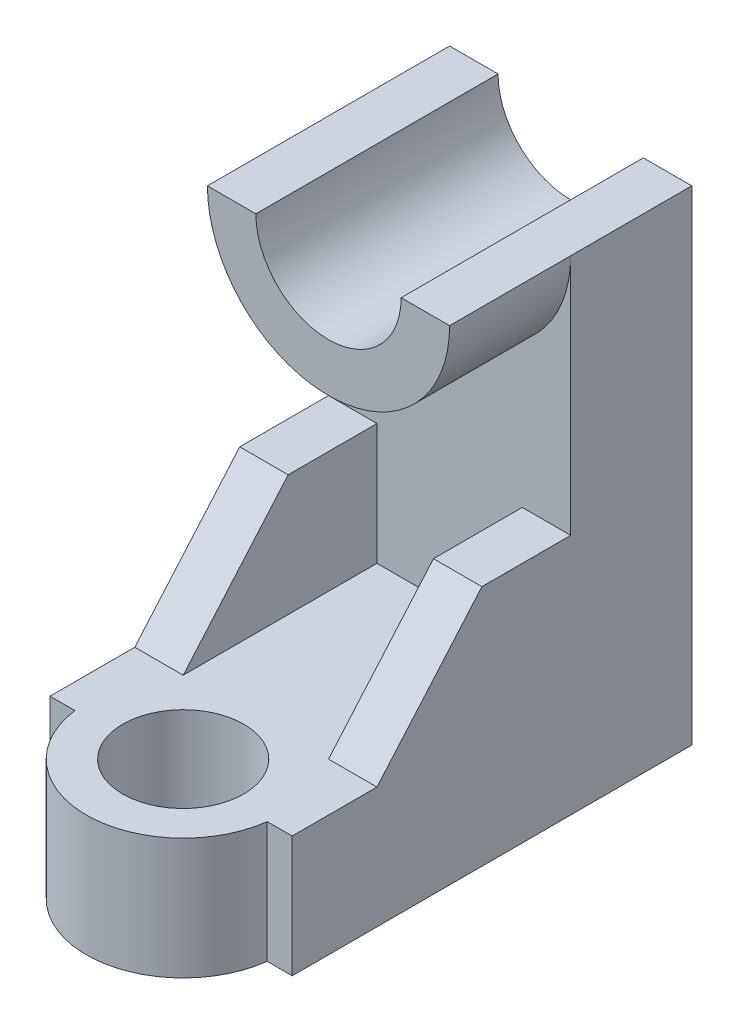
ISO-10303-21;
HEADER;
FILE_DESCRIPTION(('STEP AP214'),'2;1');
FILE_NAME('part.step','',(''),(''),'','','');
FILE_SCHEMA(('AUTOMOTIVE_DESIGN { 1 0 10303 214 1 1 1 1 }'));
ENDSEC;
DATA;
#1=APPLICATION_CONTEXT('core data for automotive mechanical design processes');
#2=APPLICATION_PROTOCOL_DEFINITION('international standard','automotive_design',2000,#1);
#3=PRODUCT_CONTEXT('',#1,'mechanical');
#4=PRODUCT('Part','Part','',(#3));
#5=PRODUCT_RELATED_PRODUCT_CATEGORY('part','',(#4));
#6=PRODUCT_DEFINITION_FORMATION('','',#4);
#7=PRODUCT_DEFINITION_CONTEXT('part definition',#1,'design');
#8=PRODUCT_DEFINITION('design','',#6,#7);
#9=PRODUCT_DEFINITION_SHAPE('','',#8);
#10=(LENGTH_UNIT() NAMED_UNIT(*) SI_UNIT(.MILLI.,.METRE.));
#11=(NAMED_UNIT(*) PLANE_ANGLE_UNIT() SI_UNIT($,.RADIAN.));
#12=(NAMED_UNIT(*) SI_UNIT($,.STERADIAN.) SOLID_ANGLE_UNIT());
#13=UNCERTAINTY_MEASURE_WITH_UNIT(LENGTH_MEASURE(1.E-05),#10,'distance_accuracy_value','');
#14=(GEOMETRIC_REPRESENTATION_CONTEXT(3) GLOBAL_UNCERTAINTY_ASSIGNED_CONTEXT((#13)) GLOBAL_UNIT_ASSIGNED_CONTEXT((#10,
#11,#12)) REPRESENTATION_CONTEXT('',''));
#15=CARTESIAN_POINT('',(0.,0.,0.));
#16=DIRECTION('',(0.,0.,1.));
#17=DIRECTION('',(1.,0.,0.));
#18=AXIS2_PLACEMENT_3D('',#15,#16,#17);
#19=CARTESIAN_POINT('',(0.,-40.8235887096774,100.));
#20=DIRECTION('',(0.,-1.,0.));
#21=DIRECTION('',(0.,0.,-1.));
#22=AXIS2_PLACEMENT_3D('',#19,#20,#21);
#23=PLANE('',#22);
#24=DIRECTION('',(0.,0.,-1.));
#25=VECTOR('',#24,1.);
#26=CARTESIAN_POINT('',(-75.1370967741936,-40.8235887096774,65.));
#27=LINE('',#26,#25);
#28=CARTESIAN_POINT('',(-75.1370967741936,-40.8235887096774,65.));
#29=VERTEX_POINT('',#28);
#30=CARTESIAN_POINT('',(-75.1370967741936,-40.8235887096774,25.));
#31=VERTEX_POINT('',#30);
#32=EDGE_CURVE('E298',#29,#31,#27,.T.);
#33=ORIENTED_EDGE('',*,*,#32,.F.);
#34=DIRECTION('',(-1.,0.,0.));
#35=VECTOR('',#34,1.);
#36=CARTESIAN_POINT('',(0.,-40.8235887096774,65.));
#37=LINE('',#36,#35);
#38=CARTESIAN_POINT('',(-85.1370967741936,-40.8235887096774,65.));
#39=VERTEX_POINT('',#38);
#40=EDGE_CURVE('E295',#29,#39,#37,.T.);
#41=ORIENTED_EDGE('',*,*,#40,.T.);
#42=DIRECTION('',(0.,0.,-1.));
#43=VECTOR('',#42,1.);
#44=CARTESIAN_POINT('',(-85.1370967741936,-40.8235887096774,100.));
#45=LINE('',#44,#43);
#46=CARTESIAN_POINT('',(-85.1370967741936,-40.8235887096774,82.5));
#47=VERTEX_POINT('',#46);
#48=EDGE_CURVE('E70',#47,#39,#45,.T.);
#49=ORIENTED_EDGE('',*,*,#48,.F.);
#50=DIRECTION('',(-1.,0.,0.));
#51=VECTOR('',#50,1.);
#52=CARTESIAN_POINT('',(0.,-40.8235887096774,82.5));
#53=LINE('',#52,#51);
#54=CARTESIAN_POINT('',(-79.980231607178,-40.8235887096774,82.5));
#55=VERTEX_POINT('',#54);
#56=EDGE_CURVE('E340',#55,#47,#53,.T.);
#57=ORIENTED_EDGE('',*,*,#56,.F.);
#58=CARTESIAN_POINT('',(-60.1370967741936,-40.8235887096774,80.));
#59=DIRECTION('',(0.,1.,0.));
#60=DIRECTION('',(0.,0.,1.));
#61=AXIS2_PLACEMENT_3D('',#58,#59,#60);
#62=CIRCLE('',#61,20.);
#63=CARTESIAN_POINT('',(-40.2939619412091,-40.8235887096774,82.5));
#64=VERTEX_POINT('',#63);
#65=EDGE_CURVE('E360',#55,#64,#62,.T.);
#66=ORIENTED_EDGE('',*,*,#65,.T.);
#67=DIRECTION('',(-1.,0.,0.));
#68=VECTOR('',#67,1.);
#69=CARTESIAN_POINT('',(0.,-40.8235887096774,82.5));
#70=LINE('',#69,#68);
#71=CARTESIAN_POINT('',(-35.1370967741936,-40.8235887096774,82.5));
#72=VERTEX_POINT('',#71);
#73=EDGE_CURVE('E209',#72,#64,#70,.T.);
#74=ORIENTED_EDGE('',*,*,#73,.F.);
#75=DIRECTION('',(0.,0.,-1.));
#76=VECTOR('',#75,1.);
#77=CARTESIAN_POINT('',(-35.1370967741936,-40.8235887096774,100.));
#78=LINE('',#77,#76);
#79=CARTESIAN_POINT('',(-35.1370967741936,-40.8235887096774,65.));
#80=VERTEX_POINT('',#79);
#81=EDGE_CURVE('E201',#72,#80,#78,.T.);
#82=ORIENTED_EDGE('',*,*,#81,.T.);
#83=DIRECTION('',(-1.,0.,0.));
#84=VECTOR('',#83,1.);
#85=CARTESIAN_POINT('',(0.,-40.8235887096774,65.));
#86=LINE('',#85,#84);
#87=CARTESIAN_POINT('',(-45.1370967741936,-40.8235887096774,65.));
#88=VERTEX_POINT('',#87);
#89=EDGE_CURVE('E184',#80,#88,#86,.T.);
#90=ORIENTED_EDGE('',*,*,#89,.T.);
#91=DIRECTION('',(0.,0.,-1.));
#92=VECTOR('',#91,1.);
#93=CARTESIAN_POINT('',(-45.1370967741936,-40.8235887096774,65.));
#94=LINE('',#93,#92);
#95=CARTESIAN_POINT('',(-45.1370967741936,-40.8235887096774,25.));
#96=VERTEX_POINT('',#95);
#97=EDGE_CURVE('E291',#88,#96,#94,.T.);
#98=ORIENTED_EDGE('',*,*,#97,.T.);
#99=DIRECTION('',(-1.,0.,0.));
#100=VECTOR('',#99,1.);
#101=CARTESIAN_POINT('',(0.,-40.8235887096774,25.));
#102=LINE('',#101,#100);
#103=EDGE_CURVE('E77',#96,#31,#102,.T.);
#104=ORIENTED_EDGE('',*,*,#103,.T.);
#105=EDGE_LOOP('',(#33,#41,#49,#57,#66,#74,#82,#90,#98,#104));
#106=FACE_BOUND('',#105,.T.);
#107=CARTESIAN_POINT('',(-60.1370967741936,-40.8235887096774,80.));
#108=DIRECTION('',(0.,1.,0.));
#109=DIRECTION('',(0.,0.,1.));
#110=AXIS2_PLACEMENT_3D('',#107,#108,#109);
#111=CIRCLE('',#110,12.5);
#112=CARTESIAN_POINT('',(-60.1370967741936,-40.8235887096774,92.5));
#113=VERTEX_POINT('',#112);
#114=EDGE_CURVE('E235',#113,#113,#111,.T.);
#115=ORIENTED_EDGE('',*,*,#114,.F.);
#116=EDGE_LOOP('',(#115));
#117=FACE_BOUND('',#116,.T.);
#118=ADVANCED_FACE('F63',(#106,#117),#23,.F.);
#119=CARTESIAN_POINT('',(0.,-65.8235887096774,100.));
#120=DIRECTION('',(0.,1.,0.));
#121=DIRECTION('',(0.,0.,1.));
#122=AXIS2_PLACEMENT_3D('',#119,#120,#121);
#123=PLANE('',#122);
#124=CARTESIAN_POINT('',(-60.1370967741936,-65.8235887096774,80.));
#125=DIRECTION('',(0.,1.,0.));
#126=DIRECTION('',(0.,0.,1.));
#127=AXIS2_PLACEMENT_3D('',#124,#125,#126);
#128=CIRCLE('',#127,12.5);
#129=CARTESIAN_POINT('',(-60.1370967741936,-65.8235887096774,92.5));
#130=VERTEX_POINT('',#129);
#131=EDGE_CURVE('E221',#130,#130,#128,.T.);
#132=ORIENTED_EDGE('',*,*,#131,.T.);
#133=EDGE_LOOP('',(#132));
#134=FACE_BOUND('',#133,.T.);
#135=CARTESIAN_POINT('',(-60.1370967741936,-65.8235887096774,80.));
#136=DIRECTION('',(0.,1.,0.));
#137=DIRECTION('',(0.,0.,1.));
#138=AXIS2_PLACEMENT_3D('',#135,#136,#137);
#139=CIRCLE('',#138,20.);
#140=CARTESIAN_POINT('',(-79.980231607178,-65.8235887096774,82.5));
#141=VERTEX_POINT('',#140);
#142=CARTESIAN_POINT('',(-40.2939619412091,-65.8235887096774,82.5));
#143=VERTEX_POINT('',#142);
#144=EDGE_CURVE('E231',#141,#143,#139,.T.);
#145=ORIENTED_EDGE('',*,*,#144,.F.);
#146=DIRECTION('',(-1.,0.,0.));
#147=VECTOR('',#146,1.);
#148=CARTESIAN_POINT('',(0.,-65.8235887096774,82.5));
#149=LINE('',#148,#147);
#150=CARTESIAN_POINT('',(-85.1370967741936,-65.8235887096774,82.5));
#151=VERTEX_POINT('',#150);
#152=EDGE_CURVE('E358',#141,#151,#149,.T.);
#153=ORIENTED_EDGE('',*,*,#152,.T.);
#154=DIRECTION('',(0.,0.,-1.));
#155=VECTOR('',#154,1.);
#156=CARTESIAN_POINT('',(-85.1370967741936,-65.8235887096774,100.));
#157=LINE('',#156,#155);
#158=CARTESIAN_POINT('',(-85.1370967741936,-65.8235887096774,0.));
#159=VERTEX_POINT('',#158);
#160=EDGE_CURVE('E213',#151,#159,#157,.T.);
#161=ORIENTED_EDGE('',*,*,#160,.T.);
#162=DIRECTION('',(1.,0.,0.));
#163=VECTOR('',#162,1.);
#164=CARTESIAN_POINT('',(0.,-65.8235887096774,0.));
#165=LINE('',#164,#163);
#166=CARTESIAN_POINT('',(-35.1370967741936,-65.8235887096774,0.));
#167=VERTEX_POINT('',#166);
#168=EDGE_CURVE('E215',#159,#167,#165,.T.);
#169=ORIENTED_EDGE('',*,*,#168,.T.);
#170=DIRECTION('',(0.,0.,-1.));
#171=VECTOR('',#170,1.);
#172=CARTESIAN_POINT('',(-35.1370967741936,-65.8235887096774,100.));
#173=LINE('',#172,#171);
#174=CARTESIAN_POINT('',(-35.1370967741936,-65.8235887096774,82.5));
#175=VERTEX_POINT('',#174);
#176=EDGE_CURVE('E210',#175,#167,#173,.T.);
#177=ORIENTED_EDGE('',*,*,#176,.F.);
#178=DIRECTION('',(-1.,0.,0.));
#179=VECTOR('',#178,1.);
#180=CARTESIAN_POINT('',(0.,-65.8235887096774,82.5));
#181=LINE('',#180,#179);
#182=EDGE_CURVE('E224',#175,#143,#181,.T.);
#183=ORIENTED_EDGE('',*,*,#182,.T.);
#184=EDGE_LOOP('',(#145,#153,#161,#169,#177,#183));
#185=FACE_BOUND('',#184,.T.);
#186=ADVANCED_FACE('F308',(#134,#185),#123,.F.);
#187=CARTESIAN_POINT('',(-85.1370967741936,0.,100.));
#188=DIRECTION('',(1.,0.,0.));
#189=DIRECTION('',(0.,0.,-1.));
#190=AXIS2_PLACEMENT_3D('',#187,#188,#189);
#191=PLANE('',#190);
#192=ORIENTED_EDGE('',*,*,#48,.T.);
#193=DIRECTION('',(0.,0.755689082789818,-0.654930538417842));
#194=VECTOR('',#193,1.);
#195=CARTESIAN_POINT('',(-85.1370967741936,-34.8329606394302,59.808122339119));
#196=LINE('',#195,#194);
#197=CARTESIAN_POINT('',(-85.1370967741936,-15.8235887096774,43.3333333333333));
#198=VERTEX_POINT('',#197);
#199=EDGE_CURVE('E345',#39,#198,#196,.T.);
#200=ORIENTED_EDGE('',*,*,#199,.T.);
#201=DIRECTION('',(0.,0.,-1.));
#202=VECTOR('',#201,1.);
#203=CARTESIAN_POINT('',(-85.1370967741936,-15.8235887096774,65.));
#204=LINE('',#203,#202);
#205=CARTESIAN_POINT('',(-85.1370967741936,-15.8235887096774,25.));
#206=VERTEX_POINT('',#205);
#207=EDGE_CURVE('E300',#198,#206,#204,.T.);
#208=ORIENTED_EDGE('',*,*,#207,.T.);
#209=DIRECTION('',(0.,1.,0.));
#210=VECTOR('',#209,1.);
#211=CARTESIAN_POINT('',(-85.1370967741936,0.,25.));
#212=LINE('',#211,#210);
#213=CARTESIAN_POINT('',(-85.1370967741936,34.1764112903226,25.));
#214=VERTEX_POINT('',#213);
#215=EDGE_CURVE('E268',#206,#214,#212,.T.);
#216=ORIENTED_EDGE('',*,*,#215,.T.);
#217=DIRECTION('',(0.,0.,-1.));
#218=VECTOR('',#217,1.);
#219=CARTESIAN_POINT('',(-85.1370967741936,34.1764112903226,25.));
#220=LINE('',#219,#218);
#221=CARTESIAN_POINT('',(-85.1370967741936,34.1764112903226,0.));
#222=VERTEX_POINT('',#221);
#223=EDGE_CURVE('E194',#214,#222,#220,.T.);
#224=ORIENTED_EDGE('',*,*,#223,.T.);
#225=DIRECTION('',(0.,-1.,0.));
#226=VECTOR('',#225,1.);
#227=CARTESIAN_POINT('',(-85.1370967741936,0.,0.));
#228=LINE('',#227,#226);
#229=EDGE_CURVE('E303',#222,#159,#228,.T.);
#230=ORIENTED_EDGE('',*,*,#229,.T.);
#231=ORIENTED_EDGE('',*,*,#160,.F.);
#232=DIRECTION('',(0.,1.,0.));
#233=VECTOR('',#232,1.);
#234=CARTESIAN_POINT('',(-85.1370967741936,0.,82.5));
#235=LINE('',#234,#233);
#236=EDGE_CURVE('E12',#151,#47,#235,.T.);
#237=ORIENTED_EDGE('',*,*,#236,.T.);
#238=EDGE_LOOP('',(#192,#200,#208,#216,#224,#230,#231,#237));
#239=FACE_BOUND('',#238,.T.);
#240=ADVANCED_FACE('F329',(#239),#191,.F.);
#241=CARTESIAN_POINT('',(-35.1370967741936,0.,100.));
#242=DIRECTION('',(-1.,0.,0.));
#243=DIRECTION('',(0.,0.,1.));
#244=AXIS2_PLACEMENT_3D('',#241,#242,#243);
#245=PLANE('',#244);
#246=DIRECTION('',(0.,0.,-1.));
#247=VECTOR('',#246,1.);
#248=CARTESIAN_POINT('',(-35.1370967741936,-15.8235887096774,65.));
#249=LINE('',#248,#247);
#250=CARTESIAN_POINT('',(-35.1370967741936,-15.8235887096774,43.3333333333333));
#251=VERTEX_POINT('',#250);
#252=CARTESIAN_POINT('',(-35.1370967741936,-15.8235887096774,25.));
#253=VERTEX_POINT('',#252);
#254=EDGE_CURVE('E193',#251,#253,#249,.T.);
#255=ORIENTED_EDGE('',*,*,#254,.F.);
#256=DIRECTION('',(0.,0.755689082789818,-0.654930538417842));
#257=VECTOR('',#256,1.);
#258=CARTESIAN_POINT('',(-35.1370967741936,14.6594251473719,16.9147213238906));
#259=LINE('',#258,#257);
#260=EDGE_CURVE('E187',#80,#251,#259,.T.);
#261=ORIENTED_EDGE('',*,*,#260,.F.);
#262=ORIENTED_EDGE('',*,*,#81,.F.);
#263=DIRECTION('',(0.,1.,0.));
#264=VECTOR('',#263,1.);
#265=CARTESIAN_POINT('',(-35.1370967741936,-96.8235887096774,82.5));
#266=LINE('',#265,#264);
#267=EDGE_CURVE('E363',#175,#72,#266,.T.);
#268=ORIENTED_EDGE('',*,*,#267,.F.);
#269=ORIENTED_EDGE('',*,*,#176,.T.);
#270=DIRECTION('',(0.,1.,0.));
#271=VECTOR('',#270,1.);
#272=CARTESIAN_POINT('',(-35.1370967741936,0.,0.));
#273=LINE('',#272,#271);
#274=CARTESIAN_POINT('',(-35.1370967741936,34.1764112903226,0.));
#275=VERTEX_POINT('',#274);
#276=EDGE_CURVE('E211',#167,#275,#273,.T.);
#277=ORIENTED_EDGE('',*,*,#276,.T.);
#278=DIRECTION('',(0.,0.,-1.));
#279=VECTOR('',#278,1.);
#280=CARTESIAN_POINT('',(-35.1370967741936,34.1764112903226,25.));
#281=LINE('',#280,#279);
#282=CARTESIAN_POINT('',(-35.1370967741936,34.1764112903226,25.));
#283=VERTEX_POINT('',#282);
#284=EDGE_CURVE('E285',#283,#275,#281,.T.);
#285=ORIENTED_EDGE('',*,*,#284,.F.);
#286=DIRECTION('',(0.,-1.,0.));
#287=VECTOR('',#286,1.);
#288=CARTESIAN_POINT('',(-35.1370967741936,0.,25.));
#289=LINE('',#288,#287);
#290=EDGE_CURVE('E283',#283,#253,#289,.T.);
#291=ORIENTED_EDGE('',*,*,#290,.T.);
#292=EDGE_LOOP('',(#255,#261,#262,#268,#269,#277,#285,#291));
#293=FACE_BOUND('',#292,.T.);
#294=ADVANCED_FACE('F199',(#293),#245,.F.);
#295=CARTESIAN_POINT('',(0.,0.,0.));
#296=DIRECTION('',(0.,0.,1.));
#297=DIRECTION('',(1.,0.,0.));
#298=AXIS2_PLACEMENT_3D('',#295,#296,#297);
#299=PLANE('',#298);
#300=ORIENTED_EDGE('',*,*,#229,.F.);
#301=DIRECTION('',(1.,0.,0.));
#302=VECTOR('',#301,1.);
#303=CARTESIAN_POINT('',(0.,34.1764112903226,0.));
#304=LINE('',#303,#302);
#305=CARTESIAN_POINT('',(-75.1370967741936,34.1764112903226,0.));
#306=VERTEX_POINT('',#305);
#307=EDGE_CURVE('E228',#222,#306,#304,.T.);
#308=ORIENTED_EDGE('',*,*,#307,.T.);
#309=CARTESIAN_POINT('',(-60.1370967741936,34.1764112903226,0.));
#310=DIRECTION('',(0.,0.,1.));
#311=DIRECTION('',(1.,0.,0.));
#312=AXIS2_PLACEMENT_3D('',#309,#310,#311);
#313=CIRCLE('',#312,15.);
#314=CARTESIAN_POINT('',(-45.1370967741936,34.1764112903226,0.));
#315=VERTEX_POINT('',#314);
#316=EDGE_CURVE('E223',#306,#315,#313,.T.);
#317=ORIENTED_EDGE('',*,*,#316,.T.);
#318=DIRECTION('',(1.,0.,0.));
#319=VECTOR('',#318,1.);
#320=CARTESIAN_POINT('',(0.,34.1764112903226,0.));
#321=LINE('',#320,#319);
#322=EDGE_CURVE('E243',#315,#275,#321,.T.);
#323=ORIENTED_EDGE('',*,*,#322,.T.);
#324=ORIENTED_EDGE('',*,*,#276,.F.);
#325=ORIENTED_EDGE('',*,*,#168,.F.);
#326=EDGE_LOOP('',(#300,#308,#317,#323,#324,#325));
#327=FACE_BOUND('',#326,.T.);
#328=ADVANCED_FACE('F312',(#327),#299,.F.);
#329=CARTESIAN_POINT('',(-75.1370967741936,0.,65.));
#330=DIRECTION('',(1.,0.,0.));
#331=DIRECTION('',(0.,0.,-1.));
#332=AXIS2_PLACEMENT_3D('',#329,#330,#331);
#333=PLANE('',#332);
#334=DIRECTION('',(0.,0.755689082789818,-0.654930538417842));
#335=VECTOR('',#334,1.);
#336=CARTESIAN_POINT('',(-75.1370967741936,-17.5106256140495,44.7954319837891));
#337=LINE('',#336,#335);
#338=CARTESIAN_POINT('',(-75.1370967741936,-15.8235887096774,43.3333333333333));
#339=VERTEX_POINT('',#338);
#340=EDGE_CURVE('E344',#29,#339,#337,.T.);
#341=ORIENTED_EDGE('',*,*,#340,.F.);
#342=ORIENTED_EDGE('',*,*,#32,.T.);
#343=DIRECTION('',(0.,-1.,0.));
#344=VECTOR('',#343,1.);
#345=CARTESIAN_POINT('',(-75.1370967741936,0.,25.));
#346=LINE('',#345,#344);
#347=CARTESIAN_POINT('',(-75.1370967741936,-15.8235887096774,25.));
#348=VERTEX_POINT('',#347);
#349=EDGE_CURVE('E274',#348,#31,#346,.T.);
#350=ORIENTED_EDGE('',*,*,#349,.F.);
#351=DIRECTION('',(0.,0.,-1.));
#352=VECTOR('',#351,1.);
#353=CARTESIAN_POINT('',(-75.1370967741936,-15.8235887096774,65.));
#354=LINE('',#353,#352);
#355=EDGE_CURVE('E85',#339,#348,#354,.T.);
#356=ORIENTED_EDGE('',*,*,#355,.F.);
#357=EDGE_LOOP('',(#341,#342,#350,#356));
#358=FACE_BOUND('',#357,.T.);
#359=ADVANCED_FACE('F347',(#358),#333,.T.);
#360=CARTESIAN_POINT('',(0.,-15.8235887096774,65.));
#361=DIRECTION('',(0.,1.,0.));
#362=DIRECTION('',(0.,0.,1.));
#363=AXIS2_PLACEMENT_3D('',#360,#361,#362);
#364=PLANE('',#363);
#365=DIRECTION('',(1.,0.,0.));
#366=VECTOR('',#365,1.);
#367=CARTESIAN_POINT('',(-91.1370967741936,-15.8235887096774,43.3333333333333));
#368=LINE('',#367,#366);
#369=EDGE_CURVE('E350',#198,#339,#368,.T.);
#370=ORIENTED_EDGE('',*,*,#369,.T.);
#371=ORIENTED_EDGE('',*,*,#355,.T.);
#372=DIRECTION('',(1.,0.,0.));
#373=VECTOR('',#372,1.);
#374=CARTESIAN_POINT('',(0.,-15.8235887096774,25.));
#375=LINE('',#374,#373);
#376=EDGE_CURVE('E271',#206,#348,#375,.T.);
#377=ORIENTED_EDGE('',*,*,#376,.F.);
#378=ORIENTED_EDGE('',*,*,#207,.F.);
#379=EDGE_LOOP('',(#370,#371,#377,#378));
#380=FACE_BOUND('',#379,.T.);
#381=ADVANCED_FACE('F386',(#380),#364,.T.);
#382=CARTESIAN_POINT('',(0.,-15.8235887096774,65.));
#383=DIRECTION('',(0.,-1.,0.));
#384=DIRECTION('',(0.,0.,-1.));
#385=AXIS2_PLACEMENT_3D('',#382,#383,#384);
#386=PLANE('',#385);
#387=DIRECTION('',(0.,0.,-1.));
#388=VECTOR('',#387,1.);
#389=CARTESIAN_POINT('',(-45.1370967741936,-15.8235887096774,65.));
#390=LINE('',#389,#388);
#391=CARTESIAN_POINT('',(-45.1370967741936,-15.8235887096774,43.3333333333333));
#392=VERTEX_POINT('',#391);
#393=CARTESIAN_POINT('',(-45.1370967741936,-15.8235887096774,25.));
#394=VERTEX_POINT('',#393);
#395=EDGE_CURVE('E293',#392,#394,#390,.T.);
#396=ORIENTED_EDGE('',*,*,#395,.F.);
#397=EDGE_CURVE('E203',#392,#251,#368,.T.);
#398=ORIENTED_EDGE('',*,*,#397,.T.);
#399=ORIENTED_EDGE('',*,*,#254,.T.);
#400=DIRECTION('',(-1.,0.,0.));
#401=VECTOR('',#400,1.);
#402=CARTESIAN_POINT('',(0.,-15.8235887096774,25.));
#403=LINE('',#402,#401);
#404=EDGE_CURVE('E280',#253,#394,#403,.T.);
#405=ORIENTED_EDGE('',*,*,#404,.T.);
#406=EDGE_LOOP('',(#396,#398,#399,#405));
#407=FACE_BOUND('',#406,.T.);
#408=ADVANCED_FACE('F389',(#407),#386,.F.);
#409=CARTESIAN_POINT('',(-45.1370967741936,0.,65.));
#410=DIRECTION('',(1.,0.,0.));
#411=DIRECTION('',(0.,0.,-1.));
#412=AXIS2_PLACEMENT_3D('',#409,#410,#411);
#413=PLANE('',#412);
#414=ORIENTED_EDGE('',*,*,#97,.F.);
#415=DIRECTION('',(0.,0.755689082789818,-0.654930538417842));
#416=VECTOR('',#415,1.);
#417=CARTESIAN_POINT('',(-45.1370967741936,-17.5106256140495,44.7954319837891));
#418=LINE('',#417,#416);
#419=EDGE_CURVE('E190',#88,#392,#418,.T.);
#420=ORIENTED_EDGE('',*,*,#419,.T.);
#421=ORIENTED_EDGE('',*,*,#395,.T.);
#422=DIRECTION('',(0.,-1.,0.));
#423=VECTOR('',#422,1.);
#424=CARTESIAN_POINT('',(-45.1370967741936,0.,25.));
#425=LINE('',#424,#423);
#426=EDGE_CURVE('E278',#394,#96,#425,.T.);
#427=ORIENTED_EDGE('',*,*,#426,.T.);
#428=EDGE_LOOP('',(#414,#420,#421,#427));
#429=FACE_BOUND('',#428,.T.);
#430=ADVANCED_FACE('F392',(#429),#413,.F.);
#431=CARTESIAN_POINT('',(0.,0.,25.));
#432=DIRECTION('',(0.,0.,1.));
#433=DIRECTION('',(1.,0.,0.));
#434=AXIS2_PLACEMENT_3D('',#431,#432,#433);
#435=PLANE('',#434);
#436=CARTESIAN_POINT('',(-60.1370967741936,34.1764112903226,25.));
#437=DIRECTION('',(0.,0.,1.));
#438=DIRECTION('',(1.,0.,0.));
#439=AXIS2_PLACEMENT_3D('',#436,#437,#438);
#440=CIRCLE('',#439,25.);
#441=EDGE_CURVE('E265',#214,#283,#440,.T.);
#442=ORIENTED_EDGE('',*,*,#441,.F.);
#443=ORIENTED_EDGE('',*,*,#215,.F.);
#444=ORIENTED_EDGE('',*,*,#376,.T.);
#445=ORIENTED_EDGE('',*,*,#349,.T.);
#446=ORIENTED_EDGE('',*,*,#103,.F.);
#447=ORIENTED_EDGE('',*,*,#426,.F.);
#448=ORIENTED_EDGE('',*,*,#404,.F.);
#449=ORIENTED_EDGE('',*,*,#290,.F.);
#450=EDGE_LOOP('',(#442,#443,#444,#445,#446,#447,#448,#449));
#451=FACE_BOUND('',#450,.T.);
#452=ADVANCED_FACE('F325',(#451),#435,.T.);
#453=CARTESIAN_POINT('',(-60.1370967741936,34.1764112903226,50.));
#454=DIRECTION('',(0.,0.,-1.));
#455=DIRECTION('',(-1.,0.,0.));
#456=AXIS2_PLACEMENT_3D('',#453,#454,#455);
#457=CYLINDRICAL_SURFACE('',#456,15.);
#458=ORIENTED_EDGE('',*,*,#316,.F.);
#459=DIRECTION('',(0.,0.,-1.));
#460=VECTOR('',#459,1.);
#461=CARTESIAN_POINT('',(-75.1370967741936,34.1764112903226,50.));
#462=LINE('',#461,#460);
#463=CARTESIAN_POINT('',(-75.1370967741936,34.1764112903226,50.));
#464=VERTEX_POINT('',#463);
#465=EDGE_CURVE('E263',#464,#306,#462,.T.);
#466=ORIENTED_EDGE('',*,*,#465,.F.);
#467=CARTESIAN_POINT('',(-60.1370967741936,34.1764112903226,50.));
#468=DIRECTION('',(0.,0.,1.));
#469=DIRECTION('',(1.,0.,0.));
#470=AXIS2_PLACEMENT_3D('',#467,#468,#469);
#471=CIRCLE('',#470,15.);
#472=CARTESIAN_POINT('',(-45.1370967741936,34.1764112903226,50.));
#473=VERTEX_POINT('',#472);
#474=EDGE_CURVE('E239',#464,#473,#471,.T.);
#475=ORIENTED_EDGE('',*,*,#474,.T.);
#476=DIRECTION('',(0.,0.,-1.));
#477=VECTOR('',#476,1.);
#478=CARTESIAN_POINT('',(-45.1370967741936,34.1764112903226,50.));
#479=LINE('',#478,#477);
#480=EDGE_CURVE('E250',#473,#315,#479,.T.);
#481=ORIENTED_EDGE('',*,*,#480,.T.);
#482=EDGE_LOOP('',(#458,#466,#475,#481));
#483=FACE_BOUND('',#482,.T.);
#484=ADVANCED_FACE('F399',(#483),#457,.F.);
#485=CARTESIAN_POINT('',(0.,34.1764112903226,50.));
#486=DIRECTION('',(0.,1.,0.));
#487=DIRECTION('',(0.,0.,1.));
#488=AXIS2_PLACEMENT_3D('',#485,#486,#487);
#489=PLANE('',#488);
#490=ORIENTED_EDGE('',*,*,#307,.F.);
#491=ORIENTED_EDGE('',*,*,#223,.F.);
#492=DIRECTION('',(0.,0.,-1.));
#493=VECTOR('',#492,1.);
#494=CARTESIAN_POINT('',(-85.1370967741936,34.1764112903226,50.));
#495=LINE('',#494,#493);
#496=CARTESIAN_POINT('',(-85.1370967741936,34.1764112903226,50.));
#497=VERTEX_POINT('',#496);
#498=EDGE_CURVE('E260',#497,#214,#495,.T.);
#499=ORIENTED_EDGE('',*,*,#498,.F.);
#500=DIRECTION('',(1.,0.,0.));
#501=VECTOR('',#500,1.);
#502=CARTESIAN_POINT('',(0.,34.1764112903226,50.));
#503=LINE('',#502,#501);
#504=EDGE_CURVE('E242',#497,#464,#503,.T.);
#505=ORIENTED_EDGE('',*,*,#504,.T.);
#506=ORIENTED_EDGE('',*,*,#465,.T.);
#507=EDGE_LOOP('',(#490,#491,#499,#505,#506));
#508=FACE_BOUND('',#507,.T.);
#509=ADVANCED_FACE('F334',(#508),#489,.T.);
#510=CARTESIAN_POINT('',(-60.1370967741936,34.1764112903226,50.));
#511=DIRECTION('',(0.,0.,-1.));
#512=DIRECTION('',(-1.,0.,0.));
#513=AXIS2_PLACEMENT_3D('',#510,#511,#512);
#514=CYLINDRICAL_SURFACE('',#513,25.);
#515=ORIENTED_EDGE('',*,*,#441,.T.);
#516=DIRECTION('',(0.,0.,-1.));
#517=VECTOR('',#516,1.);
#518=CARTESIAN_POINT('',(-35.1370967741936,34.1764112903226,50.));
#519=LINE('',#518,#517);
#520=CARTESIAN_POINT('',(-35.1370967741936,34.1764112903226,50.));
#521=VERTEX_POINT('',#520);
#522=EDGE_CURVE('E257',#521,#283,#519,.T.);
#523=ORIENTED_EDGE('',*,*,#522,.F.);
#524=CARTESIAN_POINT('',(-60.1370967741936,34.1764112903226,50.));
#525=DIRECTION('',(0.,0.,1.));
#526=DIRECTION('',(1.,0.,0.));
#527=AXIS2_PLACEMENT_3D('',#524,#525,#526);
#528=CIRCLE('',#527,25.);
#529=EDGE_CURVE('E246',#497,#521,#528,.T.);
#530=ORIENTED_EDGE('',*,*,#529,.F.);
#531=ORIENTED_EDGE('',*,*,#498,.T.);
#532=EDGE_LOOP('',(#515,#523,#530,#531));
#533=FACE_BOUND('',#532,.T.);
#534=ADVANCED_FACE('F321',(#533),#514,.T.);
#535=CARTESIAN_POINT('',(0.,34.1764112903226,50.));
#536=DIRECTION('',(0.,1.,0.));
#537=DIRECTION('',(0.,0.,1.));
#538=AXIS2_PLACEMENT_3D('',#535,#536,#537);
#539=PLANE('',#538);
#540=ORIENTED_EDGE('',*,*,#322,.F.);
#541=ORIENTED_EDGE('',*,*,#480,.F.);
#542=DIRECTION('',(1.,0.,0.));
#543=VECTOR('',#542,1.);
#544=CARTESIAN_POINT('',(0.,34.1764112903226,50.));
#545=LINE('',#544,#543);
#546=EDGE_CURVE('E248',#473,#521,#545,.T.);
#547=ORIENTED_EDGE('',*,*,#546,.T.);
#548=ORIENTED_EDGE('',*,*,#522,.T.);
#549=ORIENTED_EDGE('',*,*,#284,.T.);
#550=EDGE_LOOP('',(#540,#541,#547,#548,#549));
#551=FACE_BOUND('',#550,.T.);
#552=ADVANCED_FACE('F316',(#551),#539,.T.);
#553=CARTESIAN_POINT('',(0.,0.,50.));
#554=DIRECTION('',(0.,0.,1.));
#555=DIRECTION('',(1.,0.,0.));
#556=AXIS2_PLACEMENT_3D('',#553,#554,#555);
#557=PLANE('',#556);
#558=ORIENTED_EDGE('',*,*,#474,.F.);
#559=ORIENTED_EDGE('',*,*,#504,.F.);
#560=ORIENTED_EDGE('',*,*,#529,.T.);
#561=ORIENTED_EDGE('',*,*,#546,.F.);
#562=EDGE_LOOP('',(#558,#559,#560,#561));
#563=FACE_BOUND('',#562,.T.);
#564=ADVANCED_FACE('F409',(#563),#557,.T.);
#565=CARTESIAN_POINT('',(0.,-96.8235887096774,82.5));
#566=DIRECTION('',(0.,0.,-1.));
#567=DIRECTION('',(-1.,0.,0.));
#568=AXIS2_PLACEMENT_3D('',#565,#566,#567);
#569=PLANE('',#568);
#570=ORIENTED_EDGE('',*,*,#267,.T.);
#571=ORIENTED_EDGE('',*,*,#73,.T.);
#572=DIRECTION('',(0.,1.,0.));
#573=VECTOR('',#572,1.);
#574=CARTESIAN_POINT('',(-40.2939619412091,-96.8235887096774,82.5));
#575=LINE('',#574,#573);
#576=EDGE_CURVE('E364',#143,#64,#575,.T.);
#577=ORIENTED_EDGE('',*,*,#576,.F.);
#578=ORIENTED_EDGE('',*,*,#182,.F.);
#579=EDGE_LOOP('',(#570,#571,#577,#578));
#580=FACE_BOUND('',#579,.T.);
#581=ADVANCED_FACE('F412',(#580),#569,.F.);
#582=CARTESIAN_POINT('',(-60.1370967741936,-96.8235887096774,80.));
#583=DIRECTION('',(0.,1.,0.));
#584=DIRECTION('',(0.,0.,1.));
#585=AXIS2_PLACEMENT_3D('',#582,#583,#584);
#586=CYLINDRICAL_SURFACE('',#585,20.);
#587=ORIENTED_EDGE('',*,*,#144,.T.);
#588=ORIENTED_EDGE('',*,*,#576,.T.);
#589=ORIENTED_EDGE('',*,*,#65,.F.);
#590=DIRECTION('',(0.,1.,0.));
#591=VECTOR('',#590,1.);
#592=CARTESIAN_POINT('',(-79.980231607178,-96.8235887096774,82.5));
#593=LINE('',#592,#591);
#594=EDGE_CURVE('E355',#141,#55,#593,.T.);
#595=ORIENTED_EDGE('',*,*,#594,.F.);
#596=EDGE_LOOP('',(#587,#588,#589,#595));
#597=FACE_BOUND('',#596,.T.);
#598=ADVANCED_FACE('F417',(#597),#586,.T.);
#599=CARTESIAN_POINT('',(-60.1370967741936,-96.8235887096774,80.));
#600=DIRECTION('',(0.,1.,0.));
#601=DIRECTION('',(0.,0.,1.));
#602=AXIS2_PLACEMENT_3D('',#599,#600,#601);
#603=CYLINDRICAL_SURFACE('',#602,12.5);
#604=ORIENTED_EDGE('',*,*,#114,.T.);
#605=EDGE_LOOP('',(#604));
#606=FACE_BOUND('',#605,.T.);
#607=ORIENTED_EDGE('',*,*,#131,.F.);
#608=EDGE_LOOP('',(#607));
#609=FACE_BOUND('',#608,.T.);
#610=ADVANCED_FACE('F369',(#606,#609),#603,.F.);
#611=CARTESIAN_POINT('',(0.,-96.8235887096774,82.5));
#612=DIRECTION('',(0.,0.,-1.));
#613=DIRECTION('',(-1.,0.,0.));
#614=AXIS2_PLACEMENT_3D('',#611,#612,#613);
#615=PLANE('',#614);
#616=ORIENTED_EDGE('',*,*,#594,.T.);
#617=ORIENTED_EDGE('',*,*,#56,.T.);
#618=ORIENTED_EDGE('',*,*,#236,.F.);
#619=ORIENTED_EDGE('',*,*,#152,.F.);
#620=EDGE_LOOP('',(#616,#617,#618,#619));
#621=FACE_BOUND('',#620,.T.);
#622=ADVANCED_FACE('F416',(#621),#615,.F.);
#623=CARTESIAN_POINT('',(-91.1370967741936,14.6594251473719,16.9147213238906));
#624=DIRECTION('',(0.,-0.654930538417842,-0.755689082789818));
#625=DIRECTION('',(0.,0.755689082789818,-0.654930538417842));
#626=AXIS2_PLACEMENT_3D('',#623,#624,#625);
#627=PLANE('',#626);
#628=ORIENTED_EDGE('',*,*,#89,.F.);
#629=ORIENTED_EDGE('',*,*,#260,.T.);
#630=ORIENTED_EDGE('',*,*,#397,.F.);
#631=ORIENTED_EDGE('',*,*,#419,.F.);
#632=EDGE_LOOP('',(#628,#629,#630,#631));
#633=FACE_BOUND('',#632,.T.);
#634=ADVANCED_FACE('F186',(#633),#627,.F.);
#635=ORIENTED_EDGE('',*,*,#40,.F.);
#636=ORIENTED_EDGE('',*,*,#340,.T.);
#637=ORIENTED_EDGE('',*,*,#369,.F.);
#638=ORIENTED_EDGE('',*,*,#199,.F.);
#639=EDGE_LOOP('',(#635,#636,#637,#638));
#640=FACE_BOUND('',#639,.T.);
#641=ADVANCED_FACE('F343',(#640),#627,.F.);
#642=CLOSED_SHELL('',(#118,#186,#240,#294,#328,#359,#381,#408,#430,#452,#484,#509,#534,#552,
#564,#581,#598,#610,#622,#634,#641));
#643=MANIFOLD_SOLID_BREP('B2',#642);
#644=ADVANCED_BREP_SHAPE_REPRESENTATION('',(#18,#643),#14);
#645=SHAPE_DEFINITION_REPRESENTATION(#9,#644);
ENDSEC;
END-ISO-10303-21;
